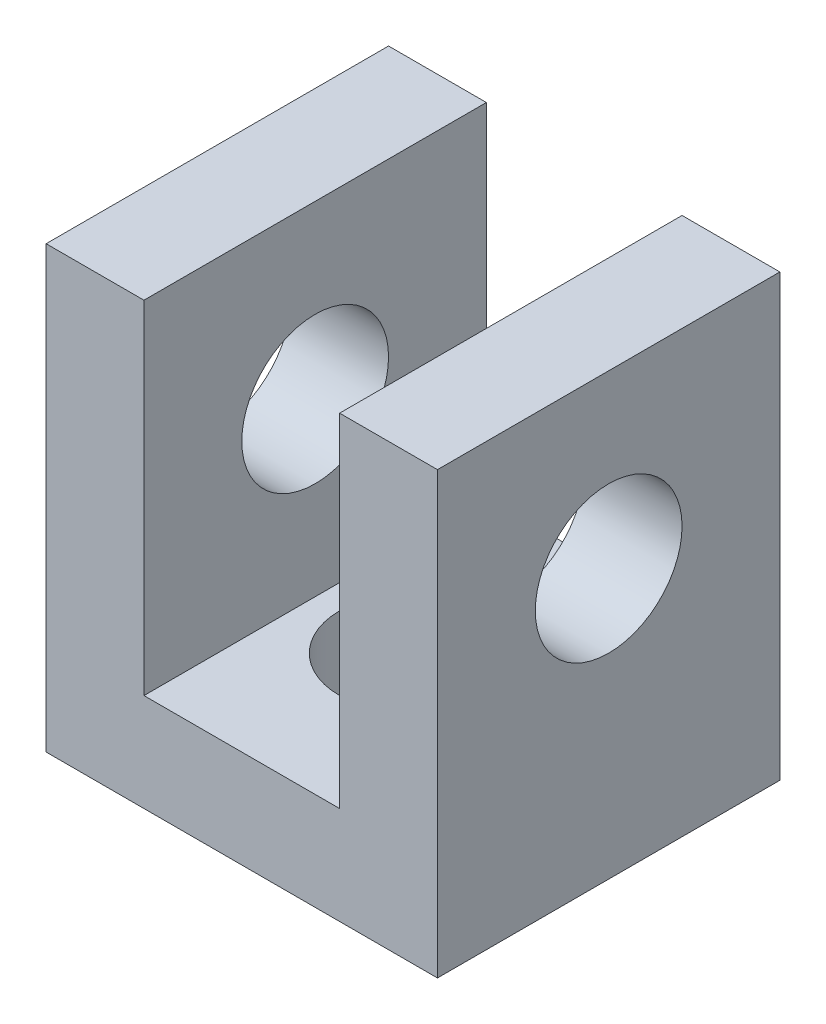
ISO-10303-21;
HEADER;
FILE_DESCRIPTION(('STEP AP214'),'2;1');
FILE_NAME('part.step','',(''),(''),'','','');
FILE_SCHEMA(('AUTOMOTIVE_DESIGN { 1 0 10303 214 1 1 1 1 }'));
ENDSEC;
DATA;
#1=APPLICATION_CONTEXT('core data for automotive mechanical design processes');
#2=APPLICATION_PROTOCOL_DEFINITION('international standard','automotive_design',2000,#1);
#3=PRODUCT_CONTEXT('',#1,'mechanical');
#4=PRODUCT('Part','Part','',(#3));
#5=PRODUCT_RELATED_PRODUCT_CATEGORY('part','',(#4));
#6=PRODUCT_DEFINITION_FORMATION('','',#4);
#7=PRODUCT_DEFINITION_CONTEXT('part definition',#1,'design');
#8=PRODUCT_DEFINITION('design','',#6,#7);
#9=PRODUCT_DEFINITION_SHAPE('','',#8);
#10=(LENGTH_UNIT() NAMED_UNIT(*) SI_UNIT(.MILLI.,.METRE.));
#11=(NAMED_UNIT(*) PLANE_ANGLE_UNIT() SI_UNIT($,.RADIAN.));
#12=(NAMED_UNIT(*) SI_UNIT($,.STERADIAN.) SOLID_ANGLE_UNIT());
#13=UNCERTAINTY_MEASURE_WITH_UNIT(LENGTH_MEASURE(1.E-05),#10,'distance_accuracy_value','');
#14=(GEOMETRIC_REPRESENTATION_CONTEXT(3) GLOBAL_UNCERTAINTY_ASSIGNED_CONTEXT((#13)) GLOBAL_UNIT_ASSIGNED_CONTEXT((#10,
#11,#12)) REPRESENTATION_CONTEXT('',''));
#15=CARTESIAN_POINT('',(0.,0.,0.));
#16=DIRECTION('',(0.,0.,1.));
#17=DIRECTION('',(1.,0.,0.));
#18=AXIS2_PLACEMENT_3D('',#15,#16,#17);
#19=CARTESIAN_POINT('',(-10.,45.,17.5));
#20=DIRECTION('',(0.,-1.,0.));
#21=DIRECTION('',(0.,0.,-1.));
#22=AXIS2_PLACEMENT_3D('',#19,#20,#21);
#23=PLANE('',#22);
#24=DIRECTION('',(-1.,0.,0.));
#25=VECTOR('',#24,1.);
#26=CARTESIAN_POINT('',(-10.,45.,-17.5));
#27=LINE('',#26,#25);
#28=CARTESIAN_POINT('',(-10.,45.,-17.5));
#29=VERTEX_POINT('',#28);
#30=CARTESIAN_POINT('',(-20.,45.,-17.5));
#31=VERTEX_POINT('',#30);
#32=EDGE_CURVE('E129',#29,#31,#27,.T.);
#33=ORIENTED_EDGE('',*,*,#32,.T.);
#34=DIRECTION('',(0.,0.,-1.));
#35=VECTOR('',#34,1.);
#36=CARTESIAN_POINT('',(-20.,45.,17.5));
#37=LINE('',#36,#35);
#38=CARTESIAN_POINT('',(-20.,45.,17.5));
#39=VERTEX_POINT('',#38);
#40=EDGE_CURVE('E11',#39,#31,#37,.T.);
#41=ORIENTED_EDGE('',*,*,#40,.F.);
#42=DIRECTION('',(-1.,0.,0.));
#43=VECTOR('',#42,1.);
#44=CARTESIAN_POINT('',(-10.,45.,17.5));
#45=LINE('',#44,#43);
#46=CARTESIAN_POINT('',(-10.,45.,17.5));
#47=VERTEX_POINT('',#46);
#48=EDGE_CURVE('E144',#47,#39,#45,.T.);
#49=ORIENTED_EDGE('',*,*,#48,.F.);
#50=DIRECTION('',(0.,0.,-1.));
#51=VECTOR('',#50,1.);
#52=CARTESIAN_POINT('',(-10.,45.,17.5));
#53=LINE('',#52,#51);
#54=EDGE_CURVE('E125',#47,#29,#53,.T.);
#55=ORIENTED_EDGE('',*,*,#54,.T.);
#56=EDGE_LOOP('',(#33,#41,#49,#55));
#57=FACE_BOUND('',#56,.T.);
#58=ADVANCED_FACE('F32',(#57),#23,.F.);
#59=CARTESIAN_POINT('',(-20.,45.,17.5));
#60=DIRECTION('',(1.,0.,0.));
#61=DIRECTION('',(0.,0.,-1.));
#62=AXIS2_PLACEMENT_3D('',#59,#60,#61);
#63=PLANE('',#62);
#64=CARTESIAN_POINT('',(-20.,27.5,0.));
#65=DIRECTION('',(1.,0.,0.));
#66=DIRECTION('',(0.,1.,0.));
#67=AXIS2_PLACEMENT_3D('',#64,#65,#66);
#68=CIRCLE('',#67,7.5);
#69=CARTESIAN_POINT('',(-20.,35.,0.));
#70=VERTEX_POINT('',#69);
#71=EDGE_CURVE('E183',#70,#70,#68,.T.);
#72=ORIENTED_EDGE('',*,*,#71,.T.);
#73=EDGE_LOOP('',(#72));
#74=FACE_BOUND('',#73,.T.);
#75=DIRECTION('',(0.,-1.,0.));
#76=VECTOR('',#75,1.);
#77=CARTESIAN_POINT('',(-20.,45.,-17.5));
#78=LINE('',#77,#76);
#79=CARTESIAN_POINT('',(-20.,0.,-17.5));
#80=VERTEX_POINT('',#79);
#81=EDGE_CURVE('E132',#31,#80,#78,.T.);
#82=ORIENTED_EDGE('',*,*,#81,.T.);
#83=DIRECTION('',(0.,0.,-1.));
#84=VECTOR('',#83,1.);
#85=CARTESIAN_POINT('',(-20.,0.,17.5));
#86=LINE('',#85,#84);
#87=CARTESIAN_POINT('',(-20.,0.,17.5));
#88=VERTEX_POINT('',#87);
#89=EDGE_CURVE('E41',#88,#80,#86,.T.);
#90=ORIENTED_EDGE('',*,*,#89,.F.);
#91=DIRECTION('',(0.,-1.,0.));
#92=VECTOR('',#91,1.);
#93=CARTESIAN_POINT('',(-20.,45.,17.5));
#94=LINE('',#93,#92);
#95=EDGE_CURVE('E92',#39,#88,#94,.T.);
#96=ORIENTED_EDGE('',*,*,#95,.F.);
#97=ORIENTED_EDGE('',*,*,#40,.T.);
#98=EDGE_LOOP('',(#82,#90,#96,#97));
#99=FACE_BOUND('',#98,.T.);
#100=ADVANCED_FACE('F213',(#74,#99),#63,.F.);
#101=CARTESIAN_POINT('',(-20.,0.,17.5));
#102=DIRECTION('',(0.,1.,0.));
#103=DIRECTION('',(-1.,0.,0.));
#104=AXIS2_PLACEMENT_3D('',#101,#102,#103);
#105=PLANE('',#104);
#106=CARTESIAN_POINT('',(0.,0.,0.));
#107=DIRECTION('',(0.,1.,0.));
#108=DIRECTION('',(-1.,0.,0.));
#109=AXIS2_PLACEMENT_3D('',#106,#107,#108);
#110=CIRCLE('',#109,7.5);
#111=CARTESIAN_POINT('',(-7.5,0.,0.));
#112=VERTEX_POINT('',#111);
#113=EDGE_CURVE('E184',#112,#112,#110,.T.);
#114=ORIENTED_EDGE('',*,*,#113,.T.);
#115=EDGE_LOOP('',(#114));
#116=FACE_BOUND('',#115,.T.);
#117=DIRECTION('',(1.,0.,0.));
#118=VECTOR('',#117,1.);
#119=CARTESIAN_POINT('',(-20.,0.,-17.5));
#120=LINE('',#119,#118);
#121=CARTESIAN_POINT('',(20.,0.,-17.5));
#122=VERTEX_POINT('',#121);
#123=EDGE_CURVE('E135',#80,#122,#120,.T.);
#124=ORIENTED_EDGE('',*,*,#123,.T.);
#125=DIRECTION('',(0.,0.,-1.));
#126=VECTOR('',#125,1.);
#127=CARTESIAN_POINT('',(20.,0.,17.5));
#128=LINE('',#127,#126);
#129=CARTESIAN_POINT('',(20.,0.,17.5));
#130=VERTEX_POINT('',#129);
#131=EDGE_CURVE('E151',#130,#122,#128,.T.);
#132=ORIENTED_EDGE('',*,*,#131,.F.);
#133=DIRECTION('',(1.,0.,0.));
#134=VECTOR('',#133,1.);
#135=CARTESIAN_POINT('',(-20.,0.,17.5));
#136=LINE('',#135,#134);
#137=EDGE_CURVE('E160',#88,#130,#136,.T.);
#138=ORIENTED_EDGE('',*,*,#137,.F.);
#139=ORIENTED_EDGE('',*,*,#89,.T.);
#140=EDGE_LOOP('',(#124,#132,#138,#139));
#141=FACE_BOUND('',#140,.T.);
#142=ADVANCED_FACE('F158',(#116,#141),#105,.F.);
#143=CARTESIAN_POINT('',(20.,0.,17.5));
#144=DIRECTION('',(-1.,0.,0.));
#145=DIRECTION('',(0.,-1.,0.));
#146=AXIS2_PLACEMENT_3D('',#143,#144,#145);
#147=PLANE('',#146);
#148=CARTESIAN_POINT('',(20.,27.5,0.));
#149=DIRECTION('',(1.,0.,0.));
#150=DIRECTION('',(0.,1.,0.));
#151=AXIS2_PLACEMENT_3D('',#148,#149,#150);
#152=CIRCLE('',#151,7.5);
#153=CARTESIAN_POINT('',(20.,35.,0.));
#154=VERTEX_POINT('',#153);
#155=EDGE_CURVE('E180',#154,#154,#152,.T.);
#156=ORIENTED_EDGE('',*,*,#155,.F.);
#157=EDGE_LOOP('',(#156));
#158=FACE_BOUND('',#157,.T.);
#159=DIRECTION('',(0.,1.,0.));
#160=VECTOR('',#159,1.);
#161=CARTESIAN_POINT('',(20.,0.,-17.5));
#162=LINE('',#161,#160);
#163=CARTESIAN_POINT('',(20.,45.,-17.5));
#164=VERTEX_POINT('',#163);
#165=EDGE_CURVE('E137',#122,#164,#162,.T.);
#166=ORIENTED_EDGE('',*,*,#165,.T.);
#167=DIRECTION('',(0.,0.,-1.));
#168=VECTOR('',#167,1.);
#169=CARTESIAN_POINT('',(20.,45.,17.5));
#170=LINE('',#169,#168);
#171=CARTESIAN_POINT('',(20.,45.,17.5));
#172=VERTEX_POINT('',#171);
#173=EDGE_CURVE('E148',#172,#164,#170,.T.);
#174=ORIENTED_EDGE('',*,*,#173,.F.);
#175=DIRECTION('',(0.,1.,0.));
#176=VECTOR('',#175,1.);
#177=CARTESIAN_POINT('',(20.,0.,17.5));
#178=LINE('',#177,#176);
#179=EDGE_CURVE('E172',#130,#172,#178,.T.);
#180=ORIENTED_EDGE('',*,*,#179,.F.);
#181=ORIENTED_EDGE('',*,*,#131,.T.);
#182=EDGE_LOOP('',(#166,#174,#180,#181));
#183=FACE_BOUND('',#182,.T.);
#184=ADVANCED_FACE('F168',(#158,#183),#147,.F.);
#185=CARTESIAN_POINT('',(20.,45.,17.5));
#186=DIRECTION('',(0.,-1.,0.));
#187=DIRECTION('',(0.,0.,-1.));
#188=AXIS2_PLACEMENT_3D('',#185,#186,#187);
#189=PLANE('',#188);
#190=DIRECTION('',(-1.,0.,0.));
#191=VECTOR('',#190,1.);
#192=CARTESIAN_POINT('',(20.,45.,-17.5));
#193=LINE('',#192,#191);
#194=CARTESIAN_POINT('',(9.99999999999998,45.,-17.5));
#195=VERTEX_POINT('',#194);
#196=EDGE_CURVE('E139',#164,#195,#193,.T.);
#197=ORIENTED_EDGE('',*,*,#196,.T.);
#198=DIRECTION('',(0.,0.,-1.));
#199=VECTOR('',#198,1.);
#200=CARTESIAN_POINT('',(9.99999999999998,45.,17.5));
#201=LINE('',#200,#199);
#202=CARTESIAN_POINT('',(9.99999999999998,45.,17.5));
#203=VERTEX_POINT('',#202);
#204=EDGE_CURVE('E120',#203,#195,#201,.T.);
#205=ORIENTED_EDGE('',*,*,#204,.F.);
#206=DIRECTION('',(-1.,0.,0.));
#207=VECTOR('',#206,1.);
#208=CARTESIAN_POINT('',(20.,45.,17.5));
#209=LINE('',#208,#207);
#210=EDGE_CURVE('E111',#172,#203,#209,.T.);
#211=ORIENTED_EDGE('',*,*,#210,.F.);
#212=ORIENTED_EDGE('',*,*,#173,.T.);
#213=EDGE_LOOP('',(#197,#205,#211,#212));
#214=FACE_BOUND('',#213,.T.);
#215=ADVANCED_FACE('F171',(#214),#189,.F.);
#216=CARTESIAN_POINT('',(9.99999999999998,45.,17.5));
#217=DIRECTION('',(1.,0.,0.));
#218=DIRECTION('',(0.,1.,0.));
#219=AXIS2_PLACEMENT_3D('',#216,#217,#218);
#220=PLANE('',#219);
#221=CARTESIAN_POINT('',(9.99999999999999,27.5,0.));
#222=DIRECTION('',(1.,0.,0.));
#223=DIRECTION('',(0.,1.,0.));
#224=AXIS2_PLACEMENT_3D('',#221,#222,#223);
#225=CIRCLE('',#224,7.5);
#226=CARTESIAN_POINT('',(9.99999999999999,35.,0.));
#227=VERTEX_POINT('',#226);
#228=EDGE_CURVE('E133',#227,#227,#225,.T.);
#229=ORIENTED_EDGE('',*,*,#228,.T.);
#230=EDGE_LOOP('',(#229));
#231=FACE_BOUND('',#230,.T.);
#232=DIRECTION('',(0.,-1.,0.));
#233=VECTOR('',#232,1.);
#234=CARTESIAN_POINT('',(9.99999999999998,45.,-17.5));
#235=LINE('',#234,#233);
#236=CARTESIAN_POINT('',(10.,10.,-17.5));
#237=VERTEX_POINT('',#236);
#238=EDGE_CURVE('E119',#195,#237,#235,.T.);
#239=ORIENTED_EDGE('',*,*,#238,.T.);
#240=DIRECTION('',(0.,0.,-1.));
#241=VECTOR('',#240,1.);
#242=CARTESIAN_POINT('',(10.,10.,17.5));
#243=LINE('',#242,#241);
#244=CARTESIAN_POINT('',(10.,10.,17.5));
#245=VERTEX_POINT('',#244);
#246=EDGE_CURVE('E116',#245,#237,#243,.T.);
#247=ORIENTED_EDGE('',*,*,#246,.F.);
#248=DIRECTION('',(0.,-1.,0.));
#249=VECTOR('',#248,1.);
#250=CARTESIAN_POINT('',(9.99999999999998,45.,17.5));
#251=LINE('',#250,#249);
#252=EDGE_CURVE('E105',#203,#245,#251,.T.);
#253=ORIENTED_EDGE('',*,*,#252,.F.);
#254=ORIENTED_EDGE('',*,*,#204,.T.);
#255=EDGE_LOOP('',(#239,#247,#253,#254));
#256=FACE_BOUND('',#255,.T.);
#257=ADVANCED_FACE('F117',(#231,#256),#220,.F.);
#258=CARTESIAN_POINT('',(10.,10.,17.5));
#259=DIRECTION('',(0.,-1.,0.));
#260=DIRECTION('',(1.,0.,0.));
#261=AXIS2_PLACEMENT_3D('',#258,#259,#260);
#262=PLANE('',#261);
#263=CARTESIAN_POINT('',(0.,10.,0.));
#264=DIRECTION('',(0.,1.,0.));
#265=DIRECTION('',(-1.,0.,0.));
#266=AXIS2_PLACEMENT_3D('',#263,#264,#265);
#267=CIRCLE('',#266,7.5);
#268=CARTESIAN_POINT('',(-7.5,10.,0.));
#269=VERTEX_POINT('',#268);
#270=EDGE_CURVE('E187',#269,#269,#267,.T.);
#271=ORIENTED_EDGE('',*,*,#270,.F.);
#272=EDGE_LOOP('',(#271));
#273=FACE_BOUND('',#272,.T.);
#274=DIRECTION('',(-1.,0.,0.));
#275=VECTOR('',#274,1.);
#276=CARTESIAN_POINT('',(10.,10.,-17.5));
#277=LINE('',#276,#275);
#278=CARTESIAN_POINT('',(-10.,10.,-17.5));
#279=VERTEX_POINT('',#278);
#280=EDGE_CURVE('E78',#237,#279,#277,.T.);
#281=ORIENTED_EDGE('',*,*,#280,.T.);
#282=DIRECTION('',(0.,0.,-1.));
#283=VECTOR('',#282,1.);
#284=CARTESIAN_POINT('',(-10.,10.,17.5));
#285=LINE('',#284,#283);
#286=CARTESIAN_POINT('',(-10.,10.,17.5));
#287=VERTEX_POINT('',#286);
#288=EDGE_CURVE('E121',#287,#279,#285,.T.);
#289=ORIENTED_EDGE('',*,*,#288,.F.);
#290=DIRECTION('',(-1.,0.,0.));
#291=VECTOR('',#290,1.);
#292=CARTESIAN_POINT('',(10.,10.,17.5));
#293=LINE('',#292,#291);
#294=EDGE_CURVE('E109',#245,#287,#293,.T.);
#295=ORIENTED_EDGE('',*,*,#294,.F.);
#296=ORIENTED_EDGE('',*,*,#246,.T.);
#297=EDGE_LOOP('',(#281,#289,#295,#296));
#298=FACE_BOUND('',#297,.T.);
#299=ADVANCED_FACE('F123',(#273,#298),#262,.F.);
#300=CARTESIAN_POINT('',(-10.,10.,17.5));
#301=DIRECTION('',(-1.,0.,0.));
#302=DIRECTION('',(0.,0.,1.));
#303=AXIS2_PLACEMENT_3D('',#300,#301,#302);
#304=PLANE('',#303);
#305=CARTESIAN_POINT('',(-10.,27.5,0.));
#306=DIRECTION('',(-1.,0.,0.));
#307=DIRECTION('',(0.,0.,1.));
#308=AXIS2_PLACEMENT_3D('',#305,#306,#307);
#309=CIRCLE('',#308,7.5);
#310=CARTESIAN_POINT('',(-10.,27.5,7.50000000000001));
#311=VERTEX_POINT('',#310);
#312=EDGE_CURVE('E35',#311,#311,#309,.T.);
#313=ORIENTED_EDGE('',*,*,#312,.T.);
#314=EDGE_LOOP('',(#313));
#315=FACE_BOUND('',#314,.T.);
#316=DIRECTION('',(0.,1.,0.));
#317=VECTOR('',#316,1.);
#318=CARTESIAN_POINT('',(-10.,10.,-17.5));
#319=LINE('',#318,#317);
#320=EDGE_CURVE('E84',#279,#29,#319,.T.);
#321=ORIENTED_EDGE('',*,*,#320,.T.);
#322=ORIENTED_EDGE('',*,*,#54,.F.);
#323=DIRECTION('',(0.,1.,0.));
#324=VECTOR('',#323,1.);
#325=CARTESIAN_POINT('',(-10.,10.,17.5));
#326=LINE('',#325,#324);
#327=EDGE_CURVE('E49',#287,#47,#326,.T.);
#328=ORIENTED_EDGE('',*,*,#327,.F.);
#329=ORIENTED_EDGE('',*,*,#288,.T.);
#330=EDGE_LOOP('',(#321,#322,#328,#329));
#331=FACE_BOUND('',#330,.T.);
#332=ADVANCED_FACE('F202',(#315,#331),#304,.F.);
#333=CARTESIAN_POINT('',(0.,0.,17.5));
#334=DIRECTION('',(0.,0.,1.));
#335=DIRECTION('',(1.,0.,0.));
#336=AXIS2_PLACEMENT_3D('',#333,#334,#335);
#337=PLANE('',#336);
#338=ORIENTED_EDGE('',*,*,#48,.T.);
#339=ORIENTED_EDGE('',*,*,#95,.T.);
#340=ORIENTED_EDGE('',*,*,#137,.T.);
#341=ORIENTED_EDGE('',*,*,#179,.T.);
#342=ORIENTED_EDGE('',*,*,#210,.T.);
#343=ORIENTED_EDGE('',*,*,#252,.T.);
#344=ORIENTED_EDGE('',*,*,#294,.T.);
#345=ORIENTED_EDGE('',*,*,#327,.T.);
#346=EDGE_LOOP('',(#338,#339,#340,#341,#342,#343,#344,#345));
#347=FACE_BOUND('',#346,.T.);
#348=ADVANCED_FACE('F107',(#347),#337,.T.);
#349=CARTESIAN_POINT('',(0.,0.,-17.5));
#350=DIRECTION('',(0.,0.,1.));
#351=DIRECTION('',(1.,0.,0.));
#352=AXIS2_PLACEMENT_3D('',#349,#350,#351);
#353=PLANE('',#352);
#354=ORIENTED_EDGE('',*,*,#32,.F.);
#355=ORIENTED_EDGE('',*,*,#320,.F.);
#356=ORIENTED_EDGE('',*,*,#280,.F.);
#357=ORIENTED_EDGE('',*,*,#238,.F.);
#358=ORIENTED_EDGE('',*,*,#196,.F.);
#359=ORIENTED_EDGE('',*,*,#165,.F.);
#360=ORIENTED_EDGE('',*,*,#123,.F.);
#361=ORIENTED_EDGE('',*,*,#81,.F.);
#362=EDGE_LOOP('',(#354,#355,#356,#357,#358,#359,#360,#361));
#363=FACE_BOUND('',#362,.T.);
#364=ADVANCED_FACE('F164',(#363),#353,.F.);
#365=CARTESIAN_POINT('',(-20.,27.5,0.));
#366=DIRECTION('',(1.,0.,0.));
#367=DIRECTION('',(0.,1.,0.));
#368=AXIS2_PLACEMENT_3D('',#365,#366,#367);
#369=CYLINDRICAL_SURFACE('',#368,7.5);
#370=ORIENTED_EDGE('',*,*,#71,.F.);
#371=EDGE_LOOP('',(#370));
#372=FACE_BOUND('',#371,.T.);
#373=ORIENTED_EDGE('',*,*,#312,.F.);
#374=EDGE_LOOP('',(#373));
#375=FACE_BOUND('',#374,.T.);
#376=ADVANCED_FACE('F255',(#372,#375),#369,.F.);
#377=ORIENTED_EDGE('',*,*,#155,.T.);
#378=EDGE_LOOP('',(#377));
#379=FACE_BOUND('',#378,.T.);
#380=ORIENTED_EDGE('',*,*,#228,.F.);
#381=EDGE_LOOP('',(#380));
#382=FACE_BOUND('',#381,.T.);
#383=ADVANCED_FACE('F197',(#379,#382),#369,.F.);
#384=CARTESIAN_POINT('',(0.,0.,0.));
#385=DIRECTION('',(0.,1.,0.));
#386=DIRECTION('',(-1.,0.,0.));
#387=AXIS2_PLACEMENT_3D('',#384,#385,#386);
#388=CYLINDRICAL_SURFACE('',#387,7.5);
#389=ORIENTED_EDGE('',*,*,#113,.F.);
#390=EDGE_LOOP('',(#389));
#391=FACE_BOUND('',#390,.T.);
#392=ORIENTED_EDGE('',*,*,#270,.T.);
#393=EDGE_LOOP('',(#392));
#394=FACE_BOUND('',#393,.T.);
#395=ADVANCED_FACE('F194',(#391,#394),#388,.F.);
#396=CLOSED_SHELL('',(#58,#100,#142,#184,#215,#257,#299,#332,#348,#364,#376,#383,#395));
#397=MANIFOLD_SOLID_BREP('B2',#396);
#398=ADVANCED_BREP_SHAPE_REPRESENTATION('',(#18,#397),#14);
#399=SHAPE_DEFINITION_REPRESENTATION(#9,#398);
ENDSEC;
END-ISO-10303-21;
